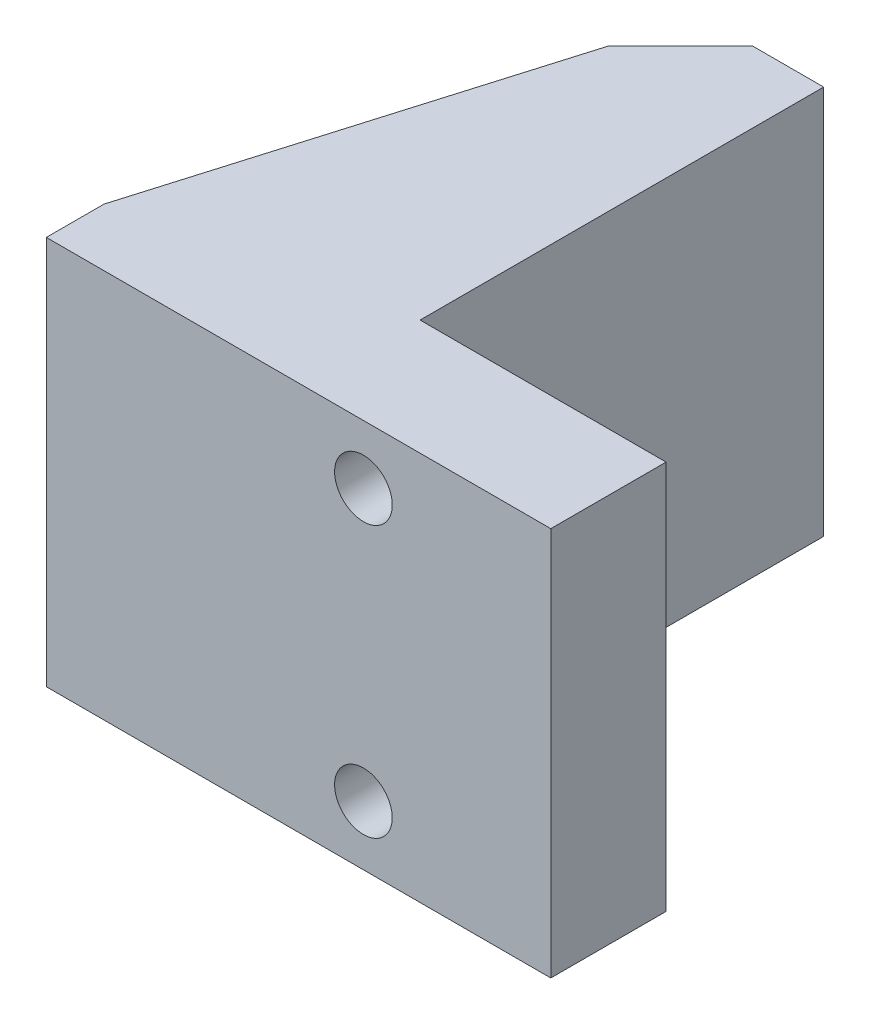
ISO-10303-21;
HEADER;
FILE_DESCRIPTION(('STEP AP214'),'2;1');
FILE_NAME('part.step','',(''),(''),'','','');
FILE_SCHEMA(('AUTOMOTIVE_DESIGN { 1 0 10303 214 1 1 1 1 }'));
ENDSEC;
DATA;
#1=APPLICATION_CONTEXT('core data for automotive mechanical design processes');
#2=APPLICATION_PROTOCOL_DEFINITION('international standard','automotive_design',2000,#1);
#3=PRODUCT_CONTEXT('',#1,'mechanical');
#4=PRODUCT('Part','Part','',(#3));
#5=PRODUCT_RELATED_PRODUCT_CATEGORY('part','',(#4));
#6=PRODUCT_DEFINITION_FORMATION('','',#4);
#7=PRODUCT_DEFINITION_CONTEXT('part definition',#1,'design');
#8=PRODUCT_DEFINITION('design','',#6,#7);
#9=PRODUCT_DEFINITION_SHAPE('','',#8);
#10=(LENGTH_UNIT() NAMED_UNIT(*) SI_UNIT(.MILLI.,.METRE.));
#11=(NAMED_UNIT(*) PLANE_ANGLE_UNIT() SI_UNIT($,.RADIAN.));
#12=(NAMED_UNIT(*) SI_UNIT($,.STERADIAN.) SOLID_ANGLE_UNIT());
#13=UNCERTAINTY_MEASURE_WITH_UNIT(LENGTH_MEASURE(1.E-05),#10,'distance_accuracy_value','');
#14=(GEOMETRIC_REPRESENTATION_CONTEXT(3) GLOBAL_UNCERTAINTY_ASSIGNED_CONTEXT((#13)) GLOBAL_UNIT_ASSIGNED_CONTEXT((#10,
#11,#12)) REPRESENTATION_CONTEXT('',''));
#15=CARTESIAN_POINT('',(0.,0.,0.));
#16=DIRECTION('',(0.,0.,1.));
#17=DIRECTION('',(1.,0.,0.));
#18=AXIS2_PLACEMENT_3D('',#15,#16,#17);
#19=CARTESIAN_POINT('',(0.,0.,5.08));
#20=DIRECTION('',(1.,0.,0.));
#21=DIRECTION('',(0.,0.,-1.));
#22=AXIS2_PLACEMENT_3D('',#19,#20,#21);
#23=PLANE('',#22);
#24=DIRECTION('',(0.,0.,1.));
#25=VECTOR('',#24,1.);
#26=CARTESIAN_POINT('',(0.,-14.605,-14.605));
#27=LINE('',#26,#25);
#28=CARTESIAN_POINT('',(0.,-14.605,-14.605));
#29=VERTEX_POINT('',#28);
#30=CARTESIAN_POINT('',(0.,-14.605,2.54));
#31=VERTEX_POINT('',#30);
#32=EDGE_CURVE('E50',#29,#31,#27,.T.);
#33=ORIENTED_EDGE('',*,*,#32,.T.);
#34=DIRECTION('',(0.,-1.,0.));
#35=VECTOR('',#34,1.);
#36=CARTESIAN_POINT('',(0.,0.,2.54));
#37=LINE('',#36,#35);
#38=CARTESIAN_POINT('',(0.,-2.54,2.54));
#39=VERTEX_POINT('',#38);
#40=EDGE_CURVE('E37',#39,#31,#37,.T.);
#41=ORIENTED_EDGE('',*,*,#40,.F.);
#42=DIRECTION('',(0.,0.,-1.));
#43=VECTOR('',#42,1.);
#44=CARTESIAN_POINT('',(0.,-2.54,-14.605));
#45=LINE('',#44,#43);
#46=CARTESIAN_POINT('',(0.,-2.54,-14.605));
#47=VERTEX_POINT('',#46);
#48=EDGE_CURVE('E149',#39,#47,#45,.T.);
#49=ORIENTED_EDGE('',*,*,#48,.T.);
#50=DIRECTION('',(0.,-1.,0.));
#51=VECTOR('',#50,1.);
#52=CARTESIAN_POINT('',(0.,0.,-14.605));
#53=LINE('',#52,#51);
#54=EDGE_CURVE('E201',#47,#29,#53,.T.);
#55=ORIENTED_EDGE('',*,*,#54,.T.);
#56=EDGE_LOOP('',(#33,#41,#49,#55));
#57=FACE_BOUND('',#56,.T.);
#58=ADVANCED_FACE('F33',(#57),#23,.F.);
#59=CARTESIAN_POINT('',(-5.08,0.,2.54));
#60=DIRECTION('',(0.,0.,1.));
#61=DIRECTION('',(0.,-1.,0.));
#62=AXIS2_PLACEMENT_3D('',#59,#60,#61);
#63=PLANE('',#62);
#64=DIRECTION('',(-1.,0.,0.));
#65=VECTOR('',#64,1.);
#66=CARTESIAN_POINT('',(0.,-14.605,2.54));
#67=LINE('',#66,#65);
#68=CARTESIAN_POINT('',(-5.08,-14.605,2.54));
#69=VERTEX_POINT('',#68);
#70=EDGE_CURVE('E57',#31,#69,#67,.T.);
#71=ORIENTED_EDGE('',*,*,#70,.T.);
#72=DIRECTION('',(0.,-1.,0.));
#73=VECTOR('',#72,1.);
#74=CARTESIAN_POINT('',(-5.08,0.,2.54));
#75=LINE('',#74,#73);
#76=CARTESIAN_POINT('',(-5.08,-2.54,2.54));
#77=VERTEX_POINT('',#76);
#78=EDGE_CURVE('E162',#77,#69,#75,.T.);
#79=ORIENTED_EDGE('',*,*,#78,.F.);
#80=DIRECTION('',(1.,0.,0.));
#81=VECTOR('',#80,1.);
#82=CARTESIAN_POINT('',(0.,-2.54,2.54));
#83=LINE('',#82,#81);
#84=EDGE_CURVE('E147',#77,#39,#83,.T.);
#85=ORIENTED_EDGE('',*,*,#84,.T.);
#86=ORIENTED_EDGE('',*,*,#40,.T.);
#87=EDGE_LOOP('',(#71,#79,#85,#86));
#88=FACE_BOUND('',#87,.T.);
#89=ADVANCED_FACE('F218',(#88),#63,.F.);
#90=CARTESIAN_POINT('',(0.,0.,0.));
#91=DIRECTION('',(0.,0.,1.));
#92=DIRECTION('',(1.,0.,0.));
#93=AXIS2_PLACEMENT_3D('',#90,#91,#92);
#94=PLANE('',#93);
#95=CARTESIAN_POINT('',(8.89,-2.5908,0.));
#96=DIRECTION('',(0.,0.,-1.));
#97=DIRECTION('',(-1.,0.,0.));
#98=AXIS2_PLACEMENT_3D('',#95,#96,#97);
#99=CIRCLE('',#98,2.54);
#100=CARTESIAN_POINT('',(6.35,-2.5908,0.));
#101=VERTEX_POINT('',#100);
#102=EDGE_CURVE('E326',#101,#101,#99,.T.);
#103=ORIENTED_EDGE('',*,*,#102,.F.);
#104=EDGE_LOOP('',(#103));
#105=FACE_BOUND('',#104,.T.);
#106=CARTESIAN_POINT('',(8.89,-14.5288,0.));
#107=DIRECTION('',(0.,0.,-1.));
#108=DIRECTION('',(-1.,0.,0.));
#109=AXIS2_PLACEMENT_3D('',#106,#107,#108);
#110=CIRCLE('',#109,2.54);
#111=CARTESIAN_POINT('',(6.35,-14.5288,0.));
#112=VERTEX_POINT('',#111);
#113=EDGE_CURVE('E194',#112,#112,#110,.T.);
#114=ORIENTED_EDGE('',*,*,#113,.F.);
#115=EDGE_LOOP('',(#114));
#116=FACE_BOUND('',#115,.T.);
#117=DIRECTION('',(0.,-1.,0.));
#118=VECTOR('',#117,1.);
#119=CARTESIAN_POINT('',(6.30770467836258,0.,0.));
#120=LINE('',#119,#118);
#121=CARTESIAN_POINT('',(6.30770467836258,0.,0.));
#122=VERTEX_POINT('',#121);
#123=CARTESIAN_POINT('',(6.30770467836258,-17.145,0.));
#124=VERTEX_POINT('',#123);
#125=EDGE_CURVE('E166',#122,#124,#120,.T.);
#126=ORIENTED_EDGE('',*,*,#125,.F.);
#127=DIRECTION('',(-1.,0.,0.));
#128=VECTOR('',#127,1.);
#129=CARTESIAN_POINT('',(0.,0.,0.));
#130=LINE('',#129,#128);
#131=CARTESIAN_POINT('',(17.145,0.,0.));
#132=VERTEX_POINT('',#131);
#133=EDGE_CURVE('E299',#132,#122,#130,.T.);
#134=ORIENTED_EDGE('',*,*,#133,.F.);
#135=DIRECTION('',(0.,1.,0.));
#136=VECTOR('',#135,1.);
#137=CARTESIAN_POINT('',(17.145,0.,0.));
#138=LINE('',#137,#136);
#139=CARTESIAN_POINT('',(17.145,-17.145,0.));
#140=VERTEX_POINT('',#139);
#141=EDGE_CURVE('E304',#140,#132,#138,.T.);
#142=ORIENTED_EDGE('',*,*,#141,.F.);
#143=DIRECTION('',(1.,0.,0.));
#144=VECTOR('',#143,1.);
#145=CARTESIAN_POINT('',(0.,-17.145,0.));
#146=LINE('',#145,#144);
#147=EDGE_CURVE('E184',#124,#140,#146,.T.);
#148=ORIENTED_EDGE('',*,*,#147,.F.);
#149=EDGE_LOOP('',(#126,#134,#142,#148));
#150=FACE_BOUND('',#149,.T.);
#151=ADVANCED_FACE('F222',(#105,#116,#150),#94,.F.);
#152=CARTESIAN_POINT('',(8.89,-14.5288,5.08));
#153=DIRECTION('',(0.,0.,-1.));
#154=DIRECTION('',(-1.,0.,0.));
#155=AXIS2_PLACEMENT_3D('',#152,#153,#154);
#156=CYLINDRICAL_SURFACE('',#155,1.27);
#157=CARTESIAN_POINT('',(8.89,-14.5288,5.08));
#158=DIRECTION('',(0.,0.,-1.));
#159=DIRECTION('',(-1.,0.,0.));
#160=AXIS2_PLACEMENT_3D('',#157,#158,#159);
#161=CIRCLE('',#160,1.27);
#162=CARTESIAN_POINT('',(7.62,-14.5288,5.08));
#163=VERTEX_POINT('',#162);
#164=EDGE_CURVE('E318',#163,#163,#161,.T.);
#165=ORIENTED_EDGE('',*,*,#164,.F.);
#166=EDGE_LOOP('',(#165));
#167=FACE_BOUND('',#166,.T.);
#168=CARTESIAN_POINT('',(8.89,-14.5288,2.54));
#169=DIRECTION('',(0.,0.,-1.));
#170=DIRECTION('',(-1.,0.,0.));
#171=AXIS2_PLACEMENT_3D('',#168,#169,#170);
#172=CIRCLE('',#171,1.27);
#173=CARTESIAN_POINT('',(7.62,-14.5288,2.54));
#174=VERTEX_POINT('',#173);
#175=EDGE_CURVE('E310',#174,#174,#172,.F.);
#176=ORIENTED_EDGE('',*,*,#175,.F.);
#177=EDGE_LOOP('',(#176));
#178=FACE_BOUND('',#177,.T.);
#179=ADVANCED_FACE('F239',(#167,#178),#156,.F.);
#180=CARTESIAN_POINT('',(8.89,-2.5908,5.08));
#181=DIRECTION('',(0.,0.,-1.));
#182=DIRECTION('',(-1.,0.,0.));
#183=AXIS2_PLACEMENT_3D('',#180,#181,#182);
#184=CYLINDRICAL_SURFACE('',#183,1.27);
#185=CARTESIAN_POINT('',(8.89,-2.5908,5.08));
#186=DIRECTION('',(0.,0.,-1.));
#187=DIRECTION('',(-1.,0.,0.));
#188=AXIS2_PLACEMENT_3D('',#185,#186,#187);
#189=CIRCLE('',#188,1.27);
#190=CARTESIAN_POINT('',(7.62,-2.5908,5.08));
#191=VERTEX_POINT('',#190);
#192=EDGE_CURVE('E323',#191,#191,#189,.T.);
#193=ORIENTED_EDGE('',*,*,#192,.F.);
#194=EDGE_LOOP('',(#193));
#195=FACE_BOUND('',#194,.T.);
#196=CARTESIAN_POINT('',(8.89,-2.5908,2.54));
#197=DIRECTION('',(0.,0.,-1.));
#198=DIRECTION('',(-1.,0.,0.));
#199=AXIS2_PLACEMENT_3D('',#196,#197,#198);
#200=CIRCLE('',#199,1.27);
#201=CARTESIAN_POINT('',(7.62,-2.5908,2.54));
#202=VERTEX_POINT('',#201);
#203=EDGE_CURVE('E316',#202,#202,#200,.F.);
#204=ORIENTED_EDGE('',*,*,#203,.F.);
#205=EDGE_LOOP('',(#204));
#206=FACE_BOUND('',#205,.T.);
#207=ADVANCED_FACE('F228',(#195,#206),#184,.F.);
#208=CARTESIAN_POINT('',(0.,-17.145,5.08));
#209=DIRECTION('',(0.,1.,0.));
#210=DIRECTION('',(0.,0.,1.));
#211=AXIS2_PLACEMENT_3D('',#208,#209,#210);
#212=PLANE('',#211);
#213=DIRECTION('',(0.284088329691374,0.,-0.958798112708387));
#214=VECTOR('',#213,1.);
#215=CARTESIAN_POINT('',(-5.08,-17.145,2.54));
#216=LINE('',#215,#214);
#217=CARTESIAN_POINT('',(-5.08,-17.145,2.54));
#218=VERTEX_POINT('',#217);
#219=CARTESIAN_POINT('',(0.,-17.145,-14.605));
#220=VERTEX_POINT('',#219);
#221=EDGE_CURVE('E131',#218,#220,#216,.T.);
#222=ORIENTED_EDGE('',*,*,#221,.T.);
#223=DIRECTION('',(-0.707106781186546,0.,0.707106781186549));
#224=VECTOR('',#223,1.);
#225=CARTESIAN_POINT('',(3.175,-17.145,-17.78));
#226=LINE('',#225,#224);
#227=CARTESIAN_POINT('',(3.175,-17.145,-17.78));
#228=VERTEX_POINT('',#227);
#229=EDGE_CURVE('E11',#220,#228,#226,.F.);
#230=ORIENTED_EDGE('',*,*,#229,.T.);
#231=DIRECTION('',(-1.,0.,0.));
#232=VECTOR('',#231,1.);
#233=CARTESIAN_POINT('',(0.,-17.145,-17.78));
#234=LINE('',#233,#232);
#235=CARTESIAN_POINT('',(6.30770467836258,-17.145,-17.78));
#236=VERTEX_POINT('',#235);
#237=EDGE_CURVE('E173',#236,#228,#234,.T.);
#238=ORIENTED_EDGE('',*,*,#237,.F.);
#239=DIRECTION('',(0.,0.,1.));
#240=VECTOR('',#239,1.);
#241=CARTESIAN_POINT('',(6.30770467836258,-17.145,-17.78));
#242=LINE('',#241,#240);
#243=EDGE_CURVE('E175',#236,#124,#242,.T.);
#244=ORIENTED_EDGE('',*,*,#243,.T.);
#245=ORIENTED_EDGE('',*,*,#147,.T.);
#246=DIRECTION('',(0.,0.,-1.));
#247=VECTOR('',#246,1.);
#248=CARTESIAN_POINT('',(17.145,-17.145,5.08));
#249=LINE('',#248,#247);
#250=CARTESIAN_POINT('',(17.145,-17.145,5.08));
#251=VERTEX_POINT('',#250);
#252=EDGE_CURVE('E199',#251,#140,#249,.T.);
#253=ORIENTED_EDGE('',*,*,#252,.F.);
#254=DIRECTION('',(1.,0.,0.));
#255=VECTOR('',#254,1.);
#256=CARTESIAN_POINT('',(0.,-17.145,5.08));
#257=LINE('',#256,#255);
#258=CARTESIAN_POINT('',(-5.08,-17.145,5.08));
#259=VERTEX_POINT('',#258);
#260=EDGE_CURVE('E303',#259,#251,#257,.T.);
#261=ORIENTED_EDGE('',*,*,#260,.F.);
#262=DIRECTION('',(0.,0.,1.));
#263=VECTOR('',#262,1.);
#264=CARTESIAN_POINT('',(-5.08,-17.145,5.08));
#265=LINE('',#264,#263);
#266=EDGE_CURVE('E140',#218,#259,#265,.T.);
#267=ORIENTED_EDGE('',*,*,#266,.F.);
#268=EDGE_LOOP('',(#222,#230,#238,#244,#245,#253,#261,#267));
#269=FACE_BOUND('',#268,.T.);
#270=ADVANCED_FACE('F138',(#269),#212,.F.);
#271=CARTESIAN_POINT('',(17.145,0.,5.08));
#272=DIRECTION('',(-1.,0.,0.));
#273=DIRECTION('',(0.,-1.,0.));
#274=AXIS2_PLACEMENT_3D('',#271,#272,#273);
#275=PLANE('',#274);
#276=ORIENTED_EDGE('',*,*,#141,.T.);
#277=DIRECTION('',(0.,0.,-1.));
#278=VECTOR('',#277,1.);
#279=CARTESIAN_POINT('',(17.145,0.,5.08));
#280=LINE('',#279,#278);
#281=CARTESIAN_POINT('',(17.145,0.,5.08));
#282=VERTEX_POINT('',#281);
#283=EDGE_CURVE('E302',#282,#132,#280,.T.);
#284=ORIENTED_EDGE('',*,*,#283,.F.);
#285=DIRECTION('',(0.,1.,0.));
#286=VECTOR('',#285,1.);
#287=CARTESIAN_POINT('',(17.145,0.,5.08));
#288=LINE('',#287,#286);
#289=EDGE_CURVE('E305',#251,#282,#288,.T.);
#290=ORIENTED_EDGE('',*,*,#289,.F.);
#291=ORIENTED_EDGE('',*,*,#252,.T.);
#292=EDGE_LOOP('',(#276,#284,#290,#291));
#293=FACE_BOUND('',#292,.T.);
#294=ADVANCED_FACE('F227',(#293),#275,.F.);
#295=CARTESIAN_POINT('',(0.,0.,5.08));
#296=DIRECTION('',(0.,-1.,0.));
#297=DIRECTION('',(0.,0.,-1.));
#298=AXIS2_PLACEMENT_3D('',#295,#296,#297);
#299=PLANE('',#298);
#300=DIRECTION('',(0.707106781186546,0.,-0.707106781186549));
#301=VECTOR('',#300,1.);
#302=CARTESIAN_POINT('',(3.175,0.,-17.78));
#303=LINE('',#302,#301);
#304=CARTESIAN_POINT('',(3.175,0.,-17.78));
#305=VERTEX_POINT('',#304);
#306=CARTESIAN_POINT('',(0.,0.,-14.605));
#307=VERTEX_POINT('',#306);
#308=EDGE_CURVE('E198',#305,#307,#303,.F.);
#309=ORIENTED_EDGE('',*,*,#308,.T.);
#310=DIRECTION('',(-0.284088329691374,0.,0.958798112708387));
#311=VECTOR('',#310,1.);
#312=CARTESIAN_POINT('',(-5.08,0.,2.54));
#313=LINE('',#312,#311);
#314=CARTESIAN_POINT('',(-5.08,0.,2.54));
#315=VERTEX_POINT('',#314);
#316=EDGE_CURVE('E134',#307,#315,#313,.T.);
#317=ORIENTED_EDGE('',*,*,#316,.T.);
#318=DIRECTION('',(0.,0.,-1.));
#319=VECTOR('',#318,1.);
#320=CARTESIAN_POINT('',(-5.08,0.,5.08));
#321=LINE('',#320,#319);
#322=CARTESIAN_POINT('',(-5.08,0.,5.08));
#323=VERTEX_POINT('',#322);
#324=EDGE_CURVE('E160',#323,#315,#321,.T.);
#325=ORIENTED_EDGE('',*,*,#324,.F.);
#326=DIRECTION('',(-1.,0.,0.));
#327=VECTOR('',#326,1.);
#328=CARTESIAN_POINT('',(0.,0.,5.08));
#329=LINE('',#328,#327);
#330=EDGE_CURVE('E315',#282,#323,#329,.T.);
#331=ORIENTED_EDGE('',*,*,#330,.F.);
#332=ORIENTED_EDGE('',*,*,#283,.T.);
#333=ORIENTED_EDGE('',*,*,#133,.T.);
#334=DIRECTION('',(0.,0.,1.));
#335=VECTOR('',#334,1.);
#336=CARTESIAN_POINT('',(6.30770467836258,0.,-17.78));
#337=LINE('',#336,#335);
#338=CARTESIAN_POINT('',(6.30770467836258,0.,-17.78));
#339=VERTEX_POINT('',#338);
#340=EDGE_CURVE('E189',#339,#122,#337,.T.);
#341=ORIENTED_EDGE('',*,*,#340,.F.);
#342=DIRECTION('',(1.,0.,0.));
#343=VECTOR('',#342,1.);
#344=CARTESIAN_POINT('',(0.,0.,-17.78));
#345=LINE('',#344,#343);
#346=EDGE_CURVE('E169',#305,#339,#345,.T.);
#347=ORIENTED_EDGE('',*,*,#346,.F.);
#348=EDGE_LOOP('',(#309,#317,#325,#331,#332,#333,#341,#347));
#349=FACE_BOUND('',#348,.T.);
#350=ADVANCED_FACE('F231',(#349),#299,.F.);
#351=CARTESIAN_POINT('',(0.,0.,5.08));
#352=DIRECTION('',(0.,0.,1.));
#353=DIRECTION('',(1.,0.,0.));
#354=AXIS2_PLACEMENT_3D('',#351,#352,#353);
#355=PLANE('',#354);
#356=ORIENTED_EDGE('',*,*,#164,.T.);
#357=EDGE_LOOP('',(#356));
#358=FACE_BOUND('',#357,.T.);
#359=ORIENTED_EDGE('',*,*,#192,.T.);
#360=EDGE_LOOP('',(#359));
#361=FACE_BOUND('',#360,.T.);
#362=ORIENTED_EDGE('',*,*,#330,.T.);
#363=DIRECTION('',(0.,1.,0.));
#364=VECTOR('',#363,1.);
#365=CARTESIAN_POINT('',(-5.08,0.,5.08));
#366=LINE('',#365,#364);
#367=EDGE_CURVE('E157',#259,#323,#366,.T.);
#368=ORIENTED_EDGE('',*,*,#367,.F.);
#369=ORIENTED_EDGE('',*,*,#260,.T.);
#370=ORIENTED_EDGE('',*,*,#289,.T.);
#371=EDGE_LOOP('',(#362,#368,#369,#370));
#372=FACE_BOUND('',#371,.T.);
#373=ADVANCED_FACE('F235',(#358,#361,#372),#355,.T.);
#374=CARTESIAN_POINT('',(8.89,-2.5908,2.54));
#375=DIRECTION('',(0.,0.,-1.));
#376=DIRECTION('',(-1.,0.,0.));
#377=AXIS2_PLACEMENT_3D('',#374,#375,#376);
#378=PLANE('',#377);
#379=CARTESIAN_POINT('',(8.89,-2.5908,2.54));
#380=DIRECTION('',(0.,0.,-1.));
#381=DIRECTION('',(-1.,0.,0.));
#382=AXIS2_PLACEMENT_3D('',#379,#380,#381);
#383=CIRCLE('',#382,2.54);
#384=CARTESIAN_POINT('',(6.35,-2.5908,2.54));
#385=VERTEX_POINT('',#384);
#386=EDGE_CURVE('E319',#385,#385,#383,.T.);
#387=ORIENTED_EDGE('',*,*,#386,.T.);
#388=EDGE_LOOP('',(#387));
#389=FACE_BOUND('',#388,.T.);
#390=ORIENTED_EDGE('',*,*,#203,.T.);
#391=EDGE_LOOP('',(#390));
#392=FACE_BOUND('',#391,.T.);
#393=ADVANCED_FACE('F243',(#389,#392),#378,.T.);
#394=CARTESIAN_POINT('',(8.89,-2.5908,2.54));
#395=DIRECTION('',(0.,0.,-1.));
#396=DIRECTION('',(-1.,0.,0.));
#397=AXIS2_PLACEMENT_3D('',#394,#395,#396);
#398=CYLINDRICAL_SURFACE('',#397,2.54);
#399=ORIENTED_EDGE('',*,*,#386,.F.);
#400=EDGE_LOOP('',(#399));
#401=FACE_BOUND('',#400,.T.);
#402=ORIENTED_EDGE('',*,*,#102,.T.);
#403=EDGE_LOOP('',(#402));
#404=FACE_BOUND('',#403,.T.);
#405=ADVANCED_FACE('F251',(#401,#404),#398,.F.);
#406=CARTESIAN_POINT('',(8.89,-14.5288,2.54));
#407=DIRECTION('',(0.,0.,-1.));
#408=DIRECTION('',(-1.,0.,0.));
#409=AXIS2_PLACEMENT_3D('',#406,#407,#408);
#410=PLANE('',#409);
#411=CARTESIAN_POINT('',(8.89,-14.5288,2.54));
#412=DIRECTION('',(0.,0.,-1.));
#413=DIRECTION('',(-1.,0.,0.));
#414=AXIS2_PLACEMENT_3D('',#411,#412,#413);
#415=CIRCLE('',#414,2.54);
#416=CARTESIAN_POINT('',(6.35,-14.5288,2.54));
#417=VERTEX_POINT('',#416);
#418=EDGE_CURVE('E178',#417,#417,#415,.T.);
#419=ORIENTED_EDGE('',*,*,#418,.T.);
#420=EDGE_LOOP('',(#419));
#421=FACE_BOUND('',#420,.T.);
#422=ORIENTED_EDGE('',*,*,#175,.T.);
#423=EDGE_LOOP('',(#422));
#424=FACE_BOUND('',#423,.T.);
#425=ADVANCED_FACE('F254',(#421,#424),#410,.T.);
#426=CARTESIAN_POINT('',(8.89,-14.5288,2.54));
#427=DIRECTION('',(0.,0.,-1.));
#428=DIRECTION('',(-1.,0.,0.));
#429=AXIS2_PLACEMENT_3D('',#426,#427,#428);
#430=CYLINDRICAL_SURFACE('',#429,2.54);
#431=ORIENTED_EDGE('',*,*,#418,.F.);
#432=EDGE_LOOP('',(#431));
#433=FACE_BOUND('',#432,.T.);
#434=ORIENTED_EDGE('',*,*,#113,.T.);
#435=EDGE_LOOP('',(#434));
#436=FACE_BOUND('',#435,.T.);
#437=ADVANCED_FACE('F259',(#433,#436),#430,.F.);
#438=CARTESIAN_POINT('',(6.30770467836258,0.,-17.78));
#439=DIRECTION('',(-1.,0.,0.));
#440=DIRECTION('',(0.,0.,1.));
#441=AXIS2_PLACEMENT_3D('',#438,#439,#440);
#442=PLANE('',#441);
#443=ORIENTED_EDGE('',*,*,#125,.T.);
#444=ORIENTED_EDGE('',*,*,#243,.F.);
#445=DIRECTION('',(0.,-1.,0.));
#446=VECTOR('',#445,1.);
#447=CARTESIAN_POINT('',(6.30770467836258,0.,-17.78));
#448=LINE('',#447,#446);
#449=EDGE_CURVE('E171',#339,#236,#448,.T.);
#450=ORIENTED_EDGE('',*,*,#449,.F.);
#451=ORIENTED_EDGE('',*,*,#340,.T.);
#452=EDGE_LOOP('',(#443,#444,#450,#451));
#453=FACE_BOUND('',#452,.T.);
#454=ADVANCED_FACE('F262',(#453),#442,.F.);
#455=CARTESIAN_POINT('',(0.,0.,-17.78));
#456=DIRECTION('',(0.,0.,1.));
#457=DIRECTION('',(1.,0.,0.));
#458=AXIS2_PLACEMENT_3D('',#455,#456,#457);
#459=PLANE('',#458);
#460=ORIENTED_EDGE('',*,*,#237,.T.);
#461=DIRECTION('',(0.,1.,0.));
#462=VECTOR('',#461,1.);
#463=CARTESIAN_POINT('',(3.175,0.,-17.78));
#464=LINE('',#463,#462);
#465=EDGE_CURVE('E121',#228,#305,#464,.T.);
#466=ORIENTED_EDGE('',*,*,#465,.T.);
#467=ORIENTED_EDGE('',*,*,#346,.T.);
#468=ORIENTED_EDGE('',*,*,#449,.T.);
#469=EDGE_LOOP('',(#460,#466,#467,#468));
#470=FACE_BOUND('',#469,.T.);
#471=ADVANCED_FACE('F269',(#470),#459,.F.);
#472=CARTESIAN_POINT('',(-5.08,0.,0.));
#473=DIRECTION('',(1.,0.,0.));
#474=DIRECTION('',(0.,0.,-1.));
#475=AXIS2_PLACEMENT_3D('',#472,#473,#474);
#476=PLANE('',#475);
#477=ORIENTED_EDGE('',*,*,#367,.T.);
#478=ORIENTED_EDGE('',*,*,#324,.T.);
#479=EDGE_CURVE('E163',#315,#77,#75,.T.);
#480=ORIENTED_EDGE('',*,*,#479,.T.);
#481=ORIENTED_EDGE('',*,*,#78,.T.);
#482=DIRECTION('',(0.,-1.,0.));
#483=VECTOR('',#482,1.);
#484=CARTESIAN_POINT('',(-5.08,-14.605,2.54));
#485=LINE('',#484,#483);
#486=EDGE_CURVE('E135',#69,#218,#485,.T.);
#487=ORIENTED_EDGE('',*,*,#486,.T.);
#488=ORIENTED_EDGE('',*,*,#266,.T.);
#489=EDGE_LOOP('',(#477,#478,#480,#481,#487,#488));
#490=FACE_BOUND('',#489,.T.);
#491=ADVANCED_FACE('F272',(#490),#476,.F.);
#492=CARTESIAN_POINT('',(3.175,0.,-17.78));
#493=DIRECTION('',(0.707106781186549,0.,0.707106781186546));
#494=DIRECTION('',(0.,1.,0.));
#495=AXIS2_PLACEMENT_3D('',#492,#493,#494);
#496=PLANE('',#495);
#497=ORIENTED_EDGE('',*,*,#229,.F.);
#498=DIRECTION('',(0.,-1.,0.));
#499=VECTOR('',#498,1.);
#500=CARTESIAN_POINT('',(0.,-14.605,-14.605));
#501=LINE('',#500,#499);
#502=EDGE_CURVE('E119',#29,#220,#501,.T.);
#503=ORIENTED_EDGE('',*,*,#502,.F.);
#504=ORIENTED_EDGE('',*,*,#54,.F.);
#505=EDGE_CURVE('E43',#307,#47,#53,.T.);
#506=ORIENTED_EDGE('',*,*,#505,.F.);
#507=ORIENTED_EDGE('',*,*,#308,.F.);
#508=ORIENTED_EDGE('',*,*,#465,.F.);
#509=EDGE_LOOP('',(#497,#503,#504,#506,#507,#508));
#510=FACE_BOUND('',#509,.T.);
#511=ADVANCED_FACE('F35',(#510),#496,.F.);
#512=CARTESIAN_POINT('',(-5.08,-2.54,2.54));
#513=DIRECTION('',(-0.958798112708387,0.,-0.284088329691374));
#514=DIRECTION('',(-0.284088329691374,0.,0.958798112708387));
#515=AXIS2_PLACEMENT_3D('',#512,#513,#514);
#516=PLANE('',#515);
#517=ORIENTED_EDGE('',*,*,#316,.F.);
#518=ORIENTED_EDGE('',*,*,#505,.T.);
#519=DIRECTION('',(-0.284088329691374,0.,0.958798112708387));
#520=VECTOR('',#519,1.);
#521=CARTESIAN_POINT('',(-5.08,-2.54,2.54));
#522=LINE('',#521,#520);
#523=EDGE_CURVE('E152',#47,#77,#522,.T.);
#524=ORIENTED_EDGE('',*,*,#523,.T.);
#525=ORIENTED_EDGE('',*,*,#479,.F.);
#526=EDGE_LOOP('',(#517,#518,#524,#525));
#527=FACE_BOUND('',#526,.T.);
#528=ADVANCED_FACE('F278',(#527),#516,.T.);
#529=CARTESIAN_POINT('',(0.,-2.54,0.));
#530=DIRECTION('',(0.,1.,0.));
#531=DIRECTION('',(0.,0.,1.));
#532=AXIS2_PLACEMENT_3D('',#529,#530,#531);
#533=PLANE('',#532);
#534=ORIENTED_EDGE('',*,*,#84,.F.);
#535=ORIENTED_EDGE('',*,*,#523,.F.);
#536=ORIENTED_EDGE('',*,*,#48,.F.);
#537=EDGE_LOOP('',(#534,#535,#536));
#538=FACE_BOUND('',#537,.T.);
#539=ADVANCED_FACE('F215',(#538),#533,.F.);
#540=CARTESIAN_POINT('',(-5.08,-14.605,2.54));
#541=DIRECTION('',(-0.958798112708387,0.,-0.284088329691374));
#542=DIRECTION('',(-0.284088329691374,0.,0.958798112708387));
#543=AXIS2_PLACEMENT_3D('',#540,#541,#542);
#544=PLANE('',#543);
#545=ORIENTED_EDGE('',*,*,#221,.F.);
#546=ORIENTED_EDGE('',*,*,#486,.F.);
#547=DIRECTION('',(0.284088329691374,0.,-0.958798112708387));
#548=VECTOR('',#547,1.);
#549=CARTESIAN_POINT('',(-5.08,-14.605,2.54));
#550=LINE('',#549,#548);
#551=EDGE_CURVE('E133',#69,#29,#550,.T.);
#552=ORIENTED_EDGE('',*,*,#551,.T.);
#553=ORIENTED_EDGE('',*,*,#502,.T.);
#554=EDGE_LOOP('',(#545,#546,#552,#553));
#555=FACE_BOUND('',#554,.T.);
#556=ADVANCED_FACE('F129',(#555),#544,.T.);
#557=CARTESIAN_POINT('',(0.,-14.605,0.));
#558=DIRECTION('',(0.,-1.,0.));
#559=DIRECTION('',(0.,0.,-1.));
#560=AXIS2_PLACEMENT_3D('',#557,#558,#559);
#561=PLANE('',#560);
#562=ORIENTED_EDGE('',*,*,#32,.F.);
#563=ORIENTED_EDGE('',*,*,#551,.F.);
#564=ORIENTED_EDGE('',*,*,#70,.F.);
#565=EDGE_LOOP('',(#562,#563,#564));
#566=FACE_BOUND('',#565,.T.);
#567=ADVANCED_FACE('F209',(#566),#561,.F.);
#568=CLOSED_SHELL('',(#58,#89,#151,#179,#207,#270,#294,#350,#373,#393,#405,#425,#437,#454,#471,
#491,#511,#528,#539,#556,#567));
#569=MANIFOLD_SOLID_BREP('B2',#568);
#570=ADVANCED_BREP_SHAPE_REPRESENTATION('',(#18,#569),#14);
#571=SHAPE_DEFINITION_REPRESENTATION(#9,#570);
ENDSEC;
END-ISO-10303-21;
